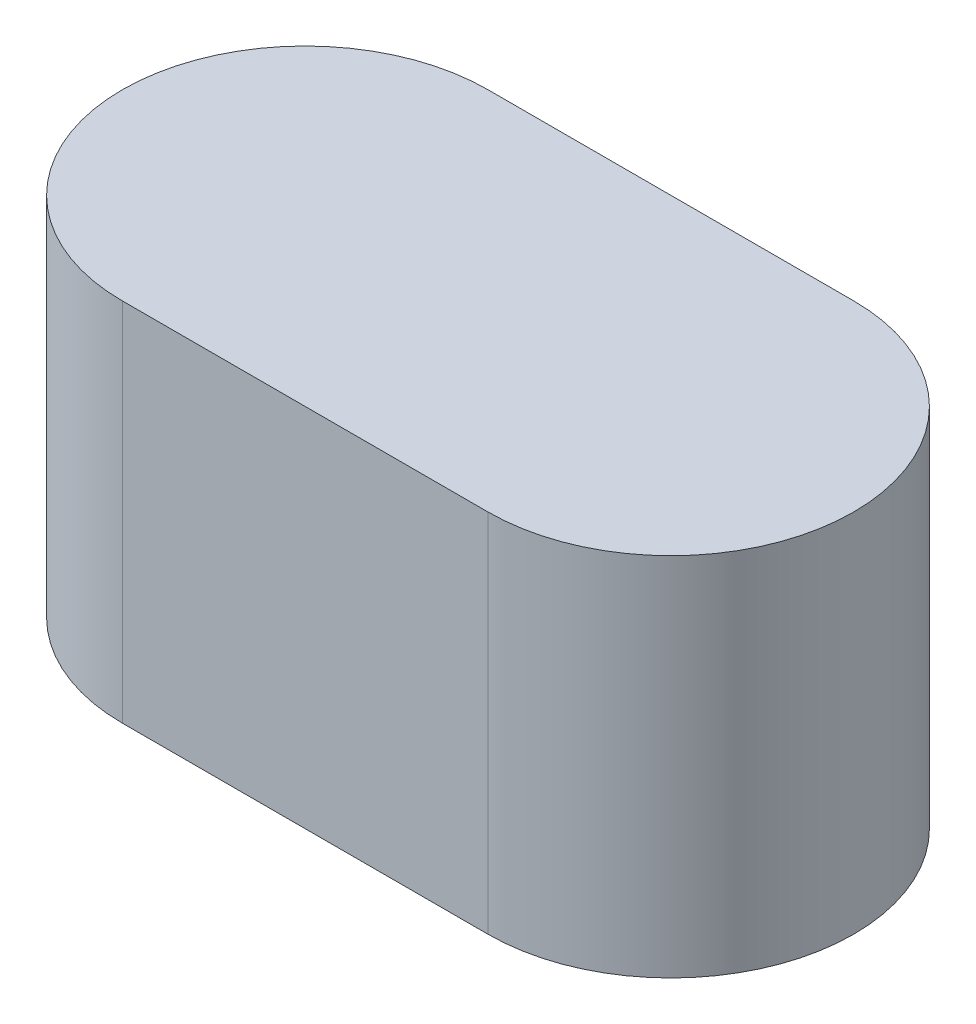
ISO-10303-21;
HEADER;
FILE_DESCRIPTION(('STEP AP214'),'2;1');
FILE_NAME('part.step','',(''),(''),'','','');
FILE_SCHEMA(('AUTOMOTIVE_DESIGN { 1 0 10303 214 1 1 1 1 }'));
ENDSEC;
DATA;
#1=APPLICATION_CONTEXT('core data for automotive mechanical design processes');
#2=APPLICATION_PROTOCOL_DEFINITION('international standard','automotive_design',2000,#1);
#3=PRODUCT_CONTEXT('',#1,'mechanical');
#4=PRODUCT('Part','Part','',(#3));
#5=PRODUCT_RELATED_PRODUCT_CATEGORY('part','',(#4));
#6=PRODUCT_DEFINITION_FORMATION('','',#4);
#7=PRODUCT_DEFINITION_CONTEXT('part definition',#1,'design');
#8=PRODUCT_DEFINITION('design','',#6,#7);
#9=PRODUCT_DEFINITION_SHAPE('','',#8);
#10=(LENGTH_UNIT() NAMED_UNIT(*) SI_UNIT(.MILLI.,.METRE.));
#11=(NAMED_UNIT(*) PLANE_ANGLE_UNIT() SI_UNIT($,.RADIAN.));
#12=(NAMED_UNIT(*) SI_UNIT($,.STERADIAN.) SOLID_ANGLE_UNIT());
#13=UNCERTAINTY_MEASURE_WITH_UNIT(LENGTH_MEASURE(1.E-05),#10,'distance_accuracy_value','');
#14=(GEOMETRIC_REPRESENTATION_CONTEXT(3) GLOBAL_UNCERTAINTY_ASSIGNED_CONTEXT((#13)) GLOBAL_UNIT_ASSIGNED_CONTEXT((#10,
#11,#12)) REPRESENTATION_CONTEXT('',''));
#15=CARTESIAN_POINT('',(0.,0.,0.));
#16=DIRECTION('',(0.,0.,1.));
#17=DIRECTION('',(1.,0.,0.));
#18=AXIS2_PLACEMENT_3D('',#15,#16,#17);
#19=CARTESIAN_POINT('',(4.,0.,-2.));
#20=DIRECTION('',(0.,1.,0.));
#21=DIRECTION('',(0.,0.,1.));
#22=AXIS2_PLACEMENT_3D('',#19,#20,#21);
#23=PLANE('',#22);
#24=DIRECTION('',(-1.,0.,0.));
#25=VECTOR('',#24,1.);
#26=CARTESIAN_POINT('',(8.,0.,-4.));
#27=LINE('',#26,#25);
#28=CARTESIAN_POINT('',(6.,0.,-4.));
#29=VERTEX_POINT('',#28);
#30=CARTESIAN_POINT('',(2.,0.,-4.));
#31=VERTEX_POINT('',#30);
#32=EDGE_CURVE('E59',#29,#31,#27,.T.);
#33=ORIENTED_EDGE('',*,*,#32,.F.);
#34=CARTESIAN_POINT('',(6.,0.,-2.));
#35=DIRECTION('',(0.,1.,0.));
#36=DIRECTION('',(0.,0.,1.));
#37=AXIS2_PLACEMENT_3D('',#34,#35,#36);
#38=CIRCLE('',#37,2.);
#39=CARTESIAN_POINT('',(6.,0.,0.));
#40=VERTEX_POINT('',#39);
#41=EDGE_CURVE('E73',#40,#29,#38,.T.);
#42=ORIENTED_EDGE('',*,*,#41,.F.);
#43=DIRECTION('',(1.,0.,0.));
#44=VECTOR('',#43,1.);
#45=CARTESIAN_POINT('',(0.,0.,0.));
#46=LINE('',#45,#44);
#47=CARTESIAN_POINT('',(2.,0.,0.));
#48=VERTEX_POINT('',#47);
#49=EDGE_CURVE('E60',#48,#40,#46,.T.);
#50=ORIENTED_EDGE('',*,*,#49,.F.);
#51=CARTESIAN_POINT('',(2.,0.,-2.));
#52=DIRECTION('',(0.,1.,0.));
#53=DIRECTION('',(0.,0.,1.));
#54=AXIS2_PLACEMENT_3D('',#51,#52,#53);
#55=CIRCLE('',#54,2.);
#56=EDGE_CURVE('E20',#31,#48,#55,.T.);
#57=ORIENTED_EDGE('',*,*,#56,.F.);
#58=EDGE_LOOP('',(#33,#42,#50,#57));
#59=FACE_BOUND('',#58,.T.);
#60=ADVANCED_FACE('F17',(#59),#23,.F.);
#61=CARTESIAN_POINT('',(2.,0.,-2.));
#62=DIRECTION('',(0.,1.,0.));
#63=DIRECTION('',(0.,0.,1.));
#64=AXIS2_PLACEMENT_3D('',#61,#62,#63);
#65=CYLINDRICAL_SURFACE('',#64,2.);
#66=ORIENTED_EDGE('',*,*,#56,.T.);
#67=DIRECTION('',(0.,1.,0.));
#68=VECTOR('',#67,1.);
#69=CARTESIAN_POINT('',(2.,0.,0.));
#70=LINE('',#69,#68);
#71=CARTESIAN_POINT('',(2.,4.,0.));
#72=VERTEX_POINT('',#71);
#73=EDGE_CURVE('E63',#72,#48,#70,.F.);
#74=ORIENTED_EDGE('',*,*,#73,.F.);
#75=CARTESIAN_POINT('',(2.,4.,-2.));
#76=DIRECTION('',(0.,1.,0.));
#77=DIRECTION('',(0.,0.,1.));
#78=AXIS2_PLACEMENT_3D('',#75,#76,#77);
#79=CIRCLE('',#78,2.);
#80=CARTESIAN_POINT('',(2.,4.,-4.));
#81=VERTEX_POINT('',#80);
#82=EDGE_CURVE('E68',#81,#72,#79,.T.);
#83=ORIENTED_EDGE('',*,*,#82,.F.);
#84=DIRECTION('',(0.,1.,0.));
#85=VECTOR('',#84,1.);
#86=CARTESIAN_POINT('',(2.,0.,-4.));
#87=LINE('',#86,#85);
#88=EDGE_CURVE('E65',#31,#81,#87,.T.);
#89=ORIENTED_EDGE('',*,*,#88,.F.);
#90=EDGE_LOOP('',(#66,#74,#83,#89));
#91=FACE_BOUND('',#90,.T.);
#92=ADVANCED_FACE('F66',(#91),#65,.T.);
#93=CARTESIAN_POINT('',(0.,0.,0.));
#94=DIRECTION('',(0.,0.,1.));
#95=DIRECTION('',(1.,0.,0.));
#96=AXIS2_PLACEMENT_3D('',#93,#94,#95);
#97=PLANE('',#96);
#98=DIRECTION('',(0.,1.,0.));
#99=VECTOR('',#98,1.);
#100=CARTESIAN_POINT('',(6.,0.,0.));
#101=LINE('',#100,#99);
#102=CARTESIAN_POINT('',(6.,4.,0.));
#103=VERTEX_POINT('',#102);
#104=EDGE_CURVE('E79',#103,#40,#101,.F.);
#105=ORIENTED_EDGE('',*,*,#104,.F.);
#106=DIRECTION('',(1.,0.,0.));
#107=VECTOR('',#106,1.);
#108=CARTESIAN_POINT('',(4.,4.,0.));
#109=LINE('',#108,#107);
#110=EDGE_CURVE('E82',#72,#103,#109,.T.);
#111=ORIENTED_EDGE('',*,*,#110,.F.);
#112=ORIENTED_EDGE('',*,*,#73,.T.);
#113=ORIENTED_EDGE('',*,*,#49,.T.);
#114=EDGE_LOOP('',(#105,#111,#112,#113));
#115=FACE_BOUND('',#114,.T.);
#116=ADVANCED_FACE('F90',(#115),#97,.T.);
#117=CARTESIAN_POINT('',(6.,0.,-2.));
#118=DIRECTION('',(0.,1.,0.));
#119=DIRECTION('',(0.,0.,1.));
#120=AXIS2_PLACEMENT_3D('',#117,#118,#119);
#121=CYLINDRICAL_SURFACE('',#120,2.);
#122=ORIENTED_EDGE('',*,*,#41,.T.);
#123=DIRECTION('',(0.,1.,0.));
#124=VECTOR('',#123,1.);
#125=CARTESIAN_POINT('',(6.,0.,-4.));
#126=LINE('',#125,#124);
#127=CARTESIAN_POINT('',(6.,4.,-4.));
#128=VERTEX_POINT('',#127);
#129=EDGE_CURVE('E35',#128,#29,#126,.F.);
#130=ORIENTED_EDGE('',*,*,#129,.F.);
#131=CARTESIAN_POINT('',(6.,4.,-2.));
#132=DIRECTION('',(0.,1.,0.));
#133=DIRECTION('',(0.,0.,1.));
#134=AXIS2_PLACEMENT_3D('',#131,#132,#133);
#135=CIRCLE('',#134,2.);
#136=EDGE_CURVE('E26',#103,#128,#135,.T.);
#137=ORIENTED_EDGE('',*,*,#136,.F.);
#138=ORIENTED_EDGE('',*,*,#104,.T.);
#139=EDGE_LOOP('',(#122,#130,#137,#138));
#140=FACE_BOUND('',#139,.T.);
#141=ADVANCED_FACE('F91',(#140),#121,.T.);
#142=CARTESIAN_POINT('',(8.,0.,-4.));
#143=DIRECTION('',(0.,0.,-1.));
#144=DIRECTION('',(-1.,0.,0.));
#145=AXIS2_PLACEMENT_3D('',#142,#143,#144);
#146=PLANE('',#145);
#147=ORIENTED_EDGE('',*,*,#88,.T.);
#148=DIRECTION('',(1.,0.,0.));
#149=VECTOR('',#148,1.);
#150=CARTESIAN_POINT('',(4.,4.,-4.));
#151=LINE('',#150,#149);
#152=EDGE_CURVE('E11',#128,#81,#151,.F.);
#153=ORIENTED_EDGE('',*,*,#152,.F.);
#154=ORIENTED_EDGE('',*,*,#129,.T.);
#155=ORIENTED_EDGE('',*,*,#32,.T.);
#156=EDGE_LOOP('',(#147,#153,#154,#155));
#157=FACE_BOUND('',#156,.T.);
#158=ADVANCED_FACE('F71',(#157),#146,.T.);
#159=CARTESIAN_POINT('',(4.,4.,-2.));
#160=DIRECTION('',(0.,1.,0.));
#161=DIRECTION('',(0.,0.,1.));
#162=AXIS2_PLACEMENT_3D('',#159,#160,#161);
#163=PLANE('',#162);
#164=ORIENTED_EDGE('',*,*,#136,.T.);
#165=ORIENTED_EDGE('',*,*,#152,.T.);
#166=ORIENTED_EDGE('',*,*,#82,.T.);
#167=ORIENTED_EDGE('',*,*,#110,.T.);
#168=EDGE_LOOP('',(#164,#165,#166,#167));
#169=FACE_BOUND('',#168,.T.);
#170=ADVANCED_FACE('F88',(#169),#163,.T.);
#171=CLOSED_SHELL('',(#60,#92,#116,#141,#158,#170));
#172=MANIFOLD_SOLID_BREP('B1',#171);
#173=ADVANCED_BREP_SHAPE_REPRESENTATION('',(#18,#172),#14);
#174=SHAPE_DEFINITION_REPRESENTATION(#9,#173);
ENDSEC;
END-ISO-10303-21;
